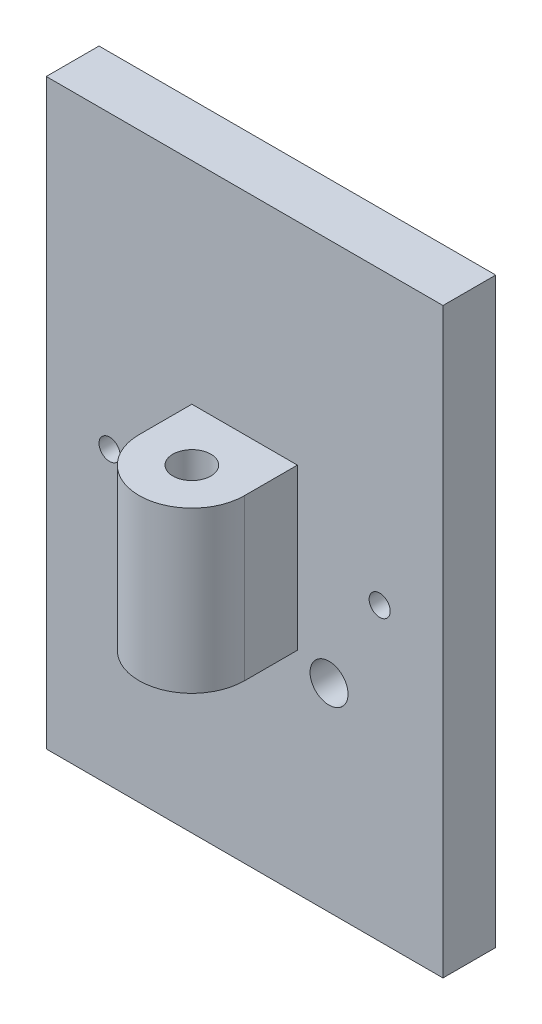
ISO-10303-21;
HEADER;
FILE_DESCRIPTION(('STEP AP214'),'2;1');
FILE_NAME('part.step','',(''),(''),'','','');
FILE_SCHEMA(('AUTOMOTIVE_DESIGN { 1 0 10303 214 1 1 1 1 }'));
ENDSEC;
DATA;
#1=APPLICATION_CONTEXT('core data for automotive mechanical design processes');
#2=APPLICATION_PROTOCOL_DEFINITION('international standard','automotive_design',2000,#1);
#3=PRODUCT_CONTEXT('',#1,'mechanical');
#4=PRODUCT('Part','Part','',(#3));
#5=PRODUCT_RELATED_PRODUCT_CATEGORY('part','',(#4));
#6=PRODUCT_DEFINITION_FORMATION('','',#4);
#7=PRODUCT_DEFINITION_CONTEXT('part definition',#1,'design');
#8=PRODUCT_DEFINITION('design','',#6,#7);
#9=PRODUCT_DEFINITION_SHAPE('','',#8);
#10=(LENGTH_UNIT() NAMED_UNIT(*) SI_UNIT(.MILLI.,.METRE.));
#11=(NAMED_UNIT(*) PLANE_ANGLE_UNIT() SI_UNIT($,.RADIAN.));
#12=(NAMED_UNIT(*) SI_UNIT($,.STERADIAN.) SOLID_ANGLE_UNIT());
#13=UNCERTAINTY_MEASURE_WITH_UNIT(LENGTH_MEASURE(1.E-05),#10,'distance_accuracy_value','');
#14=(GEOMETRIC_REPRESENTATION_CONTEXT(3) GLOBAL_UNCERTAINTY_ASSIGNED_CONTEXT((#13)) GLOBAL_UNIT_ASSIGNED_CONTEXT((#10,
#11,#12)) REPRESENTATION_CONTEXT('',''));
#15=CARTESIAN_POINT('',(0.,0.,0.));
#16=DIRECTION('',(0.,0.,1.));
#17=DIRECTION('',(1.,0.,0.));
#18=AXIS2_PLACEMENT_3D('',#15,#16,#17);
#19=CARTESIAN_POINT('',(8.763,12.7,9.525));
#20=DIRECTION('',(0.,1.,0.));
#21=DIRECTION('',(0.,0.,1.));
#22=AXIS2_PLACEMENT_3D('',#19,#20,#21);
#23=PLANE('',#22);
#24=CARTESIAN_POINT('',(11.938,12.7,6.35));
#25=DIRECTION('',(0.,1.,0.));
#26=DIRECTION('',(0.,0.,1.));
#27=AXIS2_PLACEMENT_3D('',#24,#25,#26);
#28=CIRCLE('',#27,1.143);
#29=CARTESIAN_POINT('',(11.938,12.7,7.493));
#30=VERTEX_POINT('',#29);
#31=EDGE_CURVE('E299',#30,#30,#28,.F.);
#32=ORIENTED_EDGE('',*,*,#31,.F.);
#33=EDGE_LOOP('',(#32));
#34=FACE_BOUND('',#33,.T.);
#35=DIRECTION('',(0.,0.,-1.));
#36=VECTOR('',#35,1.);
#37=CARTESIAN_POINT('',(15.113,12.7,9.525));
#38=LINE('',#37,#36);
#39=CARTESIAN_POINT('',(15.113,12.7,6.35));
#40=VERTEX_POINT('',#39);
#41=CARTESIAN_POINT('',(15.113,12.7,3.175));
#42=VERTEX_POINT('',#41);
#43=EDGE_CURVE('E147',#40,#42,#38,.T.);
#44=ORIENTED_EDGE('',*,*,#43,.F.);
#45=CARTESIAN_POINT('',(11.938,12.7,6.35));
#46=DIRECTION('',(0.,1.,0.));
#47=DIRECTION('',(0.,0.,1.));
#48=AXIS2_PLACEMENT_3D('',#45,#46,#47);
#49=CIRCLE('',#48,3.175);
#50=CARTESIAN_POINT('',(8.763,12.7,6.35));
#51=VERTEX_POINT('',#50);
#52=EDGE_CURVE('E191',#40,#51,#49,.F.);
#53=ORIENTED_EDGE('',*,*,#52,.T.);
#54=DIRECTION('',(0.,0.,-1.));
#55=VECTOR('',#54,1.);
#56=CARTESIAN_POINT('',(8.763,12.7,9.525));
#57=LINE('',#56,#55);
#58=CARTESIAN_POINT('',(8.763,12.7,3.175));
#59=VERTEX_POINT('',#58);
#60=EDGE_CURVE('E139',#51,#59,#57,.T.);
#61=ORIENTED_EDGE('',*,*,#60,.T.);
#62=DIRECTION('',(1.,0.,0.));
#63=VECTOR('',#62,1.);
#64=CARTESIAN_POINT('',(0.,12.7,3.175));
#65=LINE('',#64,#63);
#66=EDGE_CURVE('E202',#59,#42,#65,.T.);
#67=ORIENTED_EDGE('',*,*,#66,.T.);
#68=EDGE_LOOP('',(#44,#53,#61,#67));
#69=FACE_BOUND('',#68,.T.);
#70=ADVANCED_FACE('F123',(#34,#69),#23,.F.);
#71=CARTESIAN_POINT('',(8.763,22.352,9.525));
#72=DIRECTION('',(0.,-1.,0.));
#73=DIRECTION('',(0.,0.,-1.));
#74=AXIS2_PLACEMENT_3D('',#71,#72,#73);
#75=PLANE('',#74);
#76=CARTESIAN_POINT('',(11.938,22.352,6.35));
#77=DIRECTION('',(0.,-1.,0.));
#78=DIRECTION('',(0.,0.,-1.));
#79=AXIS2_PLACEMENT_3D('',#76,#77,#78);
#80=CIRCLE('',#79,1.143);
#81=CARTESIAN_POINT('',(11.938,22.352,5.207));
#82=VERTEX_POINT('',#81);
#83=EDGE_CURVE('E197',#82,#82,#80,.F.);
#84=ORIENTED_EDGE('',*,*,#83,.F.);
#85=EDGE_LOOP('',(#84));
#86=FACE_BOUND('',#85,.T.);
#87=CARTESIAN_POINT('',(11.938,22.352,6.35));
#88=DIRECTION('',(0.,-1.,0.));
#89=DIRECTION('',(0.,0.,-1.));
#90=AXIS2_PLACEMENT_3D('',#87,#88,#89);
#91=CIRCLE('',#90,3.175);
#92=CARTESIAN_POINT('',(8.763,22.352,6.35));
#93=VERTEX_POINT('',#92);
#94=CARTESIAN_POINT('',(15.113,22.352,6.35));
#95=VERTEX_POINT('',#94);
#96=EDGE_CURVE('E198',#93,#95,#91,.F.);
#97=ORIENTED_EDGE('',*,*,#96,.T.);
#98=DIRECTION('',(0.,0.,-1.));
#99=VECTOR('',#98,1.);
#100=CARTESIAN_POINT('',(15.113,22.352,9.525));
#101=LINE('',#100,#99);
#102=CARTESIAN_POINT('',(15.113,22.352,3.175));
#103=VERTEX_POINT('',#102);
#104=EDGE_CURVE('E201',#95,#103,#101,.T.);
#105=ORIENTED_EDGE('',*,*,#104,.T.);
#106=DIRECTION('',(-1.,0.,0.));
#107=VECTOR('',#106,1.);
#108=CARTESIAN_POINT('',(0.,22.352,3.175));
#109=LINE('',#108,#107);
#110=CARTESIAN_POINT('',(8.763,22.352,3.175));
#111=VERTEX_POINT('',#110);
#112=EDGE_CURVE('E207',#103,#111,#109,.T.);
#113=ORIENTED_EDGE('',*,*,#112,.T.);
#114=DIRECTION('',(0.,0.,-1.));
#115=VECTOR('',#114,1.);
#116=CARTESIAN_POINT('',(8.763,22.352,9.525));
#117=LINE('',#116,#115);
#118=EDGE_CURVE('E209',#93,#111,#117,.T.);
#119=ORIENTED_EDGE('',*,*,#118,.F.);
#120=EDGE_LOOP('',(#97,#105,#113,#119));
#121=FACE_BOUND('',#120,.T.);
#122=ADVANCED_FACE('F314',(#86,#121),#75,.F.);
#123=CARTESIAN_POINT('',(15.113,12.7,9.525));
#124=DIRECTION('',(-1.,0.,0.));
#125=DIRECTION('',(0.,0.,1.));
#126=AXIS2_PLACEMENT_3D('',#123,#124,#125);
#127=PLANE('',#126);
#128=DIRECTION('',(0.,1.,0.));
#129=VECTOR('',#128,1.);
#130=CARTESIAN_POINT('',(15.113,-6.35,6.35));
#131=LINE('',#130,#129);
#132=EDGE_CURVE('E12',#40,#95,#131,.T.);
#133=ORIENTED_EDGE('',*,*,#132,.F.);
#134=ORIENTED_EDGE('',*,*,#43,.T.);
#135=DIRECTION('',(0.,1.,0.));
#136=VECTOR('',#135,1.);
#137=CARTESIAN_POINT('',(15.113,0.,3.175));
#138=LINE('',#137,#136);
#139=EDGE_CURVE('E216',#42,#103,#138,.T.);
#140=ORIENTED_EDGE('',*,*,#139,.T.);
#141=ORIENTED_EDGE('',*,*,#104,.F.);
#142=EDGE_LOOP('',(#133,#134,#140,#141));
#143=FACE_BOUND('',#142,.T.);
#144=ADVANCED_FACE('F200',(#143),#127,.F.);
#145=CARTESIAN_POINT('',(0.,0.,3.175));
#146=DIRECTION('',(0.,0.,-1.));
#147=DIRECTION('',(-1.,0.,0.));
#148=AXIS2_PLACEMENT_3D('',#145,#146,#147);
#149=PLANE('',#148);
#150=CARTESIAN_POINT('',(3.81,17.526,3.175));
#151=DIRECTION('',(0.,0.,1.));
#152=DIRECTION('',(1.,0.,0.));
#153=AXIS2_PLACEMENT_3D('',#150,#151,#152);
#154=CIRCLE('',#153,0.635);
#155=CARTESIAN_POINT('',(4.445,17.526,3.175));
#156=VERTEX_POINT('',#155);
#157=EDGE_CURVE('E226',#156,#156,#154,.T.);
#158=ORIENTED_EDGE('',*,*,#157,.F.);
#159=EDGE_LOOP('',(#158));
#160=FACE_BOUND('',#159,.T.);
#161=CARTESIAN_POINT('',(20.066,17.526,3.175));
#162=DIRECTION('',(0.,0.,1.));
#163=DIRECTION('',(1.,0.,0.));
#164=AXIS2_PLACEMENT_3D('',#161,#162,#163);
#165=CIRCLE('',#164,0.634999999999999);
#166=CARTESIAN_POINT('',(20.701,17.526,3.175));
#167=VERTEX_POINT('',#166);
#168=EDGE_CURVE('E234',#167,#167,#165,.T.);
#169=ORIENTED_EDGE('',*,*,#168,.F.);
#170=EDGE_LOOP('',(#169));
#171=FACE_BOUND('',#170,.T.);
#172=CARTESIAN_POINT('',(17.018,11.938,3.175));
#173=DIRECTION('',(0.,0.,1.));
#174=DIRECTION('',(1.,0.,0.));
#175=AXIS2_PLACEMENT_3D('',#172,#173,#174);
#176=CIRCLE('',#175,1.143);
#177=CARTESIAN_POINT('',(18.161,11.938,3.175));
#178=VERTEX_POINT('',#177);
#179=EDGE_CURVE('E242',#178,#178,#176,.T.);
#180=ORIENTED_EDGE('',*,*,#179,.F.);
#181=EDGE_LOOP('',(#180));
#182=FACE_BOUND('',#181,.T.);
#183=CARTESIAN_POINT('',(6.858,11.938,3.175));
#184=DIRECTION('',(0.,0.,1.));
#185=DIRECTION('',(1.,0.,0.));
#186=AXIS2_PLACEMENT_3D('',#183,#184,#185);
#187=CIRCLE('',#186,1.143);
#188=CARTESIAN_POINT('',(8.001,11.938,3.175));
#189=VERTEX_POINT('',#188);
#190=EDGE_CURVE('E250',#189,#189,#187,.T.);
#191=ORIENTED_EDGE('',*,*,#190,.F.);
#192=EDGE_LOOP('',(#191));
#193=FACE_BOUND('',#192,.T.);
#194=DIRECTION('',(0.,-1.,0.));
#195=VECTOR('',#194,1.);
#196=CARTESIAN_POINT('',(0.,0.,3.175));
#197=LINE('',#196,#195);
#198=CARTESIAN_POINT('',(0.,35.052,3.175));
#199=VERTEX_POINT('',#198);
#200=CARTESIAN_POINT('',(0.,0.,3.175));
#201=VERTEX_POINT('',#200);
#202=EDGE_CURVE('E258',#199,#201,#197,.T.);
#203=ORIENTED_EDGE('',*,*,#202,.T.);
#204=DIRECTION('',(1.,0.,0.));
#205=VECTOR('',#204,1.);
#206=CARTESIAN_POINT('',(0.,0.,3.175));
#207=LINE('',#206,#205);
#208=CARTESIAN_POINT('',(23.876,0.,3.175));
#209=VERTEX_POINT('',#208);
#210=EDGE_CURVE('E262',#201,#209,#207,.T.);
#211=ORIENTED_EDGE('',*,*,#210,.T.);
#212=DIRECTION('',(0.,1.,0.));
#213=VECTOR('',#212,1.);
#214=CARTESIAN_POINT('',(23.876,0.,3.175));
#215=LINE('',#214,#213);
#216=CARTESIAN_POINT('',(23.876,35.052,3.175));
#217=VERTEX_POINT('',#216);
#218=EDGE_CURVE('E266',#209,#217,#215,.T.);
#219=ORIENTED_EDGE('',*,*,#218,.T.);
#220=DIRECTION('',(-1.,0.,0.));
#221=VECTOR('',#220,1.);
#222=CARTESIAN_POINT('',(0.,35.052,3.175));
#223=LINE('',#222,#221);
#224=EDGE_CURVE('E269',#217,#199,#223,.T.);
#225=ORIENTED_EDGE('',*,*,#224,.T.);
#226=EDGE_LOOP('',(#203,#211,#219,#225));
#227=FACE_BOUND('',#226,.T.);
#228=DIRECTION('',(0.,-1.,0.));
#229=VECTOR('',#228,1.);
#230=CARTESIAN_POINT('',(8.763,0.,3.175));
#231=LINE('',#230,#229);
#232=EDGE_CURVE('E221',#111,#59,#231,.T.);
#233=ORIENTED_EDGE('',*,*,#232,.F.);
#234=ORIENTED_EDGE('',*,*,#112,.F.);
#235=ORIENTED_EDGE('',*,*,#139,.F.);
#236=ORIENTED_EDGE('',*,*,#66,.F.);
#237=EDGE_LOOP('',(#233,#234,#235,#236));
#238=FACE_BOUND('',#237,.T.);
#239=ADVANCED_FACE('F320',(#160,#171,#182,#193,#227,#238),#149,.F.);
#240=CARTESIAN_POINT('',(0.,0.,0.));
#241=DIRECTION('',(0.,0.,-1.));
#242=DIRECTION('',(-1.,0.,0.));
#243=AXIS2_PLACEMENT_3D('',#240,#241,#242);
#244=PLANE('',#243);
#245=CARTESIAN_POINT('',(20.066,17.526,0.));
#246=DIRECTION('',(0.,0.,1.));
#247=DIRECTION('',(1.,0.,0.));
#248=AXIS2_PLACEMENT_3D('',#245,#246,#247);
#249=CIRCLE('',#248,0.634999999999999);
#250=CARTESIAN_POINT('',(20.701,17.526,0.));
#251=VERTEX_POINT('',#250);
#252=EDGE_CURVE('E230',#251,#251,#249,.T.);
#253=ORIENTED_EDGE('',*,*,#252,.T.);
#254=EDGE_LOOP('',(#253));
#255=FACE_BOUND('',#254,.T.);
#256=CARTESIAN_POINT('',(6.858,11.938,0.));
#257=DIRECTION('',(0.,0.,1.));
#258=DIRECTION('',(1.,0.,0.));
#259=AXIS2_PLACEMENT_3D('',#256,#257,#258);
#260=CIRCLE('',#259,1.143);
#261=CARTESIAN_POINT('',(8.001,11.938,0.));
#262=VERTEX_POINT('',#261);
#263=EDGE_CURVE('E246',#262,#262,#260,.T.);
#264=ORIENTED_EDGE('',*,*,#263,.T.);
#265=EDGE_LOOP('',(#264));
#266=FACE_BOUND('',#265,.T.);
#267=DIRECTION('',(0.,-1.,0.));
#268=VECTOR('',#267,1.);
#269=CARTESIAN_POINT('',(0.,0.,0.));
#270=LINE('',#269,#268);
#271=CARTESIAN_POINT('',(0.,35.052,0.));
#272=VERTEX_POINT('',#271);
#273=CARTESIAN_POINT('',(0.,0.,0.));
#274=VERTEX_POINT('',#273);
#275=EDGE_CURVE('E254',#272,#274,#270,.T.);
#276=ORIENTED_EDGE('',*,*,#275,.F.);
#277=DIRECTION('',(-1.,0.,0.));
#278=VECTOR('',#277,1.);
#279=CARTESIAN_POINT('',(0.,35.052,0.));
#280=LINE('',#279,#278);
#281=CARTESIAN_POINT('',(23.876,35.052,0.));
#282=VERTEX_POINT('',#281);
#283=EDGE_CURVE('E263',#282,#272,#280,.T.);
#284=ORIENTED_EDGE('',*,*,#283,.F.);
#285=DIRECTION('',(0.,1.,0.));
#286=VECTOR('',#285,1.);
#287=CARTESIAN_POINT('',(23.876,0.,0.));
#288=LINE('',#287,#286);
#289=CARTESIAN_POINT('',(23.876,0.,0.));
#290=VERTEX_POINT('',#289);
#291=EDGE_CURVE('E279',#290,#282,#288,.T.);
#292=ORIENTED_EDGE('',*,*,#291,.F.);
#293=DIRECTION('',(1.,0.,0.));
#294=VECTOR('',#293,1.);
#295=CARTESIAN_POINT('',(0.,0.,0.));
#296=LINE('',#295,#294);
#297=EDGE_CURVE('E276',#274,#290,#296,.T.);
#298=ORIENTED_EDGE('',*,*,#297,.F.);
#299=EDGE_LOOP('',(#276,#284,#292,#298));
#300=FACE_BOUND('',#299,.T.);
#301=CARTESIAN_POINT('',(17.018,11.938,0.));
#302=DIRECTION('',(0.,0.,1.));
#303=DIRECTION('',(1.,0.,0.));
#304=AXIS2_PLACEMENT_3D('',#301,#302,#303);
#305=CIRCLE('',#304,1.143);
#306=CARTESIAN_POINT('',(18.161,11.938,0.));
#307=VERTEX_POINT('',#306);
#308=EDGE_CURVE('E238',#307,#307,#305,.T.);
#309=ORIENTED_EDGE('',*,*,#308,.T.);
#310=EDGE_LOOP('',(#309));
#311=FACE_BOUND('',#310,.T.);
#312=CARTESIAN_POINT('',(3.81,17.526,0.));
#313=DIRECTION('',(0.,0.,1.));
#314=DIRECTION('',(1.,0.,0.));
#315=AXIS2_PLACEMENT_3D('',#312,#313,#314);
#316=CIRCLE('',#315,0.635);
#317=CARTESIAN_POINT('',(4.445,17.526,0.));
#318=VERTEX_POINT('',#317);
#319=EDGE_CURVE('E225',#318,#318,#316,.T.);
#320=ORIENTED_EDGE('',*,*,#319,.T.);
#321=EDGE_LOOP('',(#320));
#322=FACE_BOUND('',#321,.T.);
#323=ADVANCED_FACE('F322',(#255,#266,#300,#311,#322),#244,.T.);
#324=CARTESIAN_POINT('',(0.,0.,3.175));
#325=DIRECTION('',(1.,0.,0.));
#326=DIRECTION('',(0.,0.,-1.));
#327=AXIS2_PLACEMENT_3D('',#324,#325,#326);
#328=PLANE('',#327);
#329=ORIENTED_EDGE('',*,*,#275,.T.);
#330=DIRECTION('',(0.,0.,-1.));
#331=VECTOR('',#330,1.);
#332=CARTESIAN_POINT('',(0.,0.,3.175));
#333=LINE('',#332,#331);
#334=EDGE_CURVE('E132',#201,#274,#333,.T.);
#335=ORIENTED_EDGE('',*,*,#334,.F.);
#336=ORIENTED_EDGE('',*,*,#202,.F.);
#337=DIRECTION('',(0.,0.,-1.));
#338=VECTOR('',#337,1.);
#339=CARTESIAN_POINT('',(0.,35.052,3.175));
#340=LINE('',#339,#338);
#341=EDGE_CURVE('E272',#199,#272,#340,.T.);
#342=ORIENTED_EDGE('',*,*,#341,.T.);
#343=EDGE_LOOP('',(#329,#335,#336,#342));
#344=FACE_BOUND('',#343,.T.);
#345=ADVANCED_FACE('F125',(#344),#328,.F.);
#346=CARTESIAN_POINT('',(0.,0.,3.175));
#347=DIRECTION('',(0.,1.,0.));
#348=DIRECTION('',(0.,0.,1.));
#349=AXIS2_PLACEMENT_3D('',#346,#347,#348);
#350=PLANE('',#349);
#351=ORIENTED_EDGE('',*,*,#297,.T.);
#352=DIRECTION('',(0.,0.,-1.));
#353=VECTOR('',#352,1.);
#354=CARTESIAN_POINT('',(23.876,0.,3.175));
#355=LINE('',#354,#353);
#356=EDGE_CURVE('E291',#209,#290,#355,.T.);
#357=ORIENTED_EDGE('',*,*,#356,.F.);
#358=ORIENTED_EDGE('',*,*,#210,.F.);
#359=ORIENTED_EDGE('',*,*,#334,.T.);
#360=EDGE_LOOP('',(#351,#357,#358,#359));
#361=FACE_BOUND('',#360,.T.);
#362=ADVANCED_FACE('F391',(#361),#350,.F.);
#363=CARTESIAN_POINT('',(23.876,0.,3.175));
#364=DIRECTION('',(-1.,0.,0.));
#365=DIRECTION('',(0.,-1.,0.));
#366=AXIS2_PLACEMENT_3D('',#363,#364,#365);
#367=PLANE('',#366);
#368=ORIENTED_EDGE('',*,*,#291,.T.);
#369=DIRECTION('',(0.,0.,-1.));
#370=VECTOR('',#369,1.);
#371=CARTESIAN_POINT('',(23.876,35.052,3.175));
#372=LINE('',#371,#370);
#373=EDGE_CURVE('E287',#217,#282,#372,.T.);
#374=ORIENTED_EDGE('',*,*,#373,.F.);
#375=ORIENTED_EDGE('',*,*,#218,.F.);
#376=ORIENTED_EDGE('',*,*,#356,.T.);
#377=EDGE_LOOP('',(#368,#374,#375,#376));
#378=FACE_BOUND('',#377,.T.);
#379=ADVANCED_FACE('F364',(#378),#367,.F.);
#380=CARTESIAN_POINT('',(0.,35.052,3.175));
#381=DIRECTION('',(0.,-1.,0.));
#382=DIRECTION('',(0.,0.,-1.));
#383=AXIS2_PLACEMENT_3D('',#380,#381,#382);
#384=PLANE('',#383);
#385=ORIENTED_EDGE('',*,*,#283,.T.);
#386=ORIENTED_EDGE('',*,*,#341,.F.);
#387=ORIENTED_EDGE('',*,*,#224,.F.);
#388=ORIENTED_EDGE('',*,*,#373,.T.);
#389=EDGE_LOOP('',(#385,#386,#387,#388));
#390=FACE_BOUND('',#389,.T.);
#391=ADVANCED_FACE('F359',(#390),#384,.F.);
#392=CARTESIAN_POINT('',(6.858,11.938,3.175));
#393=DIRECTION('',(0.,0.,-1.));
#394=DIRECTION('',(-1.,0.,0.));
#395=AXIS2_PLACEMENT_3D('',#392,#393,#394);
#396=CYLINDRICAL_SURFACE('',#395,1.143);
#397=ORIENTED_EDGE('',*,*,#190,.T.);
#398=EDGE_LOOP('',(#397));
#399=FACE_BOUND('',#398,.T.);
#400=ORIENTED_EDGE('',*,*,#263,.F.);
#401=EDGE_LOOP('',(#400));
#402=FACE_BOUND('',#401,.T.);
#403=ADVANCED_FACE('F356',(#399,#402),#396,.F.);
#404=CARTESIAN_POINT('',(17.018,11.938,3.175));
#405=DIRECTION('',(0.,0.,-1.));
#406=DIRECTION('',(-1.,0.,0.));
#407=AXIS2_PLACEMENT_3D('',#404,#405,#406);
#408=CYLINDRICAL_SURFACE('',#407,1.143);
#409=ORIENTED_EDGE('',*,*,#179,.T.);
#410=EDGE_LOOP('',(#409));
#411=FACE_BOUND('',#410,.T.);
#412=ORIENTED_EDGE('',*,*,#308,.F.);
#413=EDGE_LOOP('',(#412));
#414=FACE_BOUND('',#413,.T.);
#415=ADVANCED_FACE('F353',(#411,#414),#408,.F.);
#416=CARTESIAN_POINT('',(20.066,17.526,3.175));
#417=DIRECTION('',(0.,0.,-1.));
#418=DIRECTION('',(-1.,0.,0.));
#419=AXIS2_PLACEMENT_3D('',#416,#417,#418);
#420=CYLINDRICAL_SURFACE('',#419,0.634999999999999);
#421=ORIENTED_EDGE('',*,*,#168,.T.);
#422=EDGE_LOOP('',(#421));
#423=FACE_BOUND('',#422,.T.);
#424=ORIENTED_EDGE('',*,*,#252,.F.);
#425=EDGE_LOOP('',(#424));
#426=FACE_BOUND('',#425,.T.);
#427=ADVANCED_FACE('F349',(#423,#426),#420,.F.);
#428=CARTESIAN_POINT('',(3.81,17.526,3.175));
#429=DIRECTION('',(0.,0.,-1.));
#430=DIRECTION('',(-1.,0.,0.));
#431=AXIS2_PLACEMENT_3D('',#428,#429,#430);
#432=CYLINDRICAL_SURFACE('',#431,0.635);
#433=ORIENTED_EDGE('',*,*,#157,.T.);
#434=EDGE_LOOP('',(#433));
#435=FACE_BOUND('',#434,.T.);
#436=ORIENTED_EDGE('',*,*,#319,.F.);
#437=EDGE_LOOP('',(#436));
#438=FACE_BOUND('',#437,.T.);
#439=ADVANCED_FACE('F346',(#435,#438),#432,.F.);
#440=CARTESIAN_POINT('',(8.763,12.7,9.525));
#441=DIRECTION('',(1.,0.,0.));
#442=DIRECTION('',(0.,0.,-1.));
#443=AXIS2_PLACEMENT_3D('',#440,#441,#442);
#444=PLANE('',#443);
#445=ORIENTED_EDGE('',*,*,#60,.F.);
#446=DIRECTION('',(0.,-1.,0.));
#447=VECTOR('',#446,1.);
#448=CARTESIAN_POINT('',(8.763,35.052,6.35));
#449=LINE('',#448,#447);
#450=EDGE_CURVE('E195',#93,#51,#449,.T.);
#451=ORIENTED_EDGE('',*,*,#450,.F.);
#452=ORIENTED_EDGE('',*,*,#118,.T.);
#453=ORIENTED_EDGE('',*,*,#232,.T.);
#454=EDGE_LOOP('',(#445,#451,#452,#453));
#455=FACE_BOUND('',#454,.T.);
#456=ADVANCED_FACE('F317',(#455),#444,.F.);
#457=CARTESIAN_POINT('',(11.938,35.052,6.35));
#458=DIRECTION('',(0.,-1.,0.));
#459=DIRECTION('',(0.,0.,-1.));
#460=AXIS2_PLACEMENT_3D('',#457,#458,#459);
#461=CYLINDRICAL_SURFACE('',#460,3.175);
#462=ORIENTED_EDGE('',*,*,#52,.F.);
#463=ORIENTED_EDGE('',*,*,#132,.T.);
#464=ORIENTED_EDGE('',*,*,#96,.F.);
#465=ORIENTED_EDGE('',*,*,#450,.T.);
#466=EDGE_LOOP('',(#462,#463,#464,#465));
#467=FACE_BOUND('',#466,.T.);
#468=ADVANCED_FACE('F192',(#467),#461,.T.);
#469=CARTESIAN_POINT('',(11.938,35.052,6.35));
#470=DIRECTION('',(0.,-1.,0.));
#471=DIRECTION('',(0.,0.,-1.));
#472=AXIS2_PLACEMENT_3D('',#469,#470,#471);
#473=CYLINDRICAL_SURFACE('',#472,1.143);
#474=ORIENTED_EDGE('',*,*,#83,.T.);
#475=EDGE_LOOP('',(#474));
#476=FACE_BOUND('',#475,.T.);
#477=ORIENTED_EDGE('',*,*,#31,.T.);
#478=EDGE_LOOP('',(#477));
#479=FACE_BOUND('',#478,.T.);
#480=ADVANCED_FACE('F440',(#476,#479),#473,.F.);
#481=CLOSED_SHELL('',(#70,#122,#144,#239,#323,#345,#362,#379,#391,#403,#415,#427,#439,#456,#468,#480));
#482=MANIFOLD_SOLID_BREP('B2',#481);
#483=ADVANCED_BREP_SHAPE_REPRESENTATION('',(#18,#482),#14);
#484=SHAPE_DEFINITION_REPRESENTATION(#9,#483);
ENDSEC;
END-ISO-10303-21;
